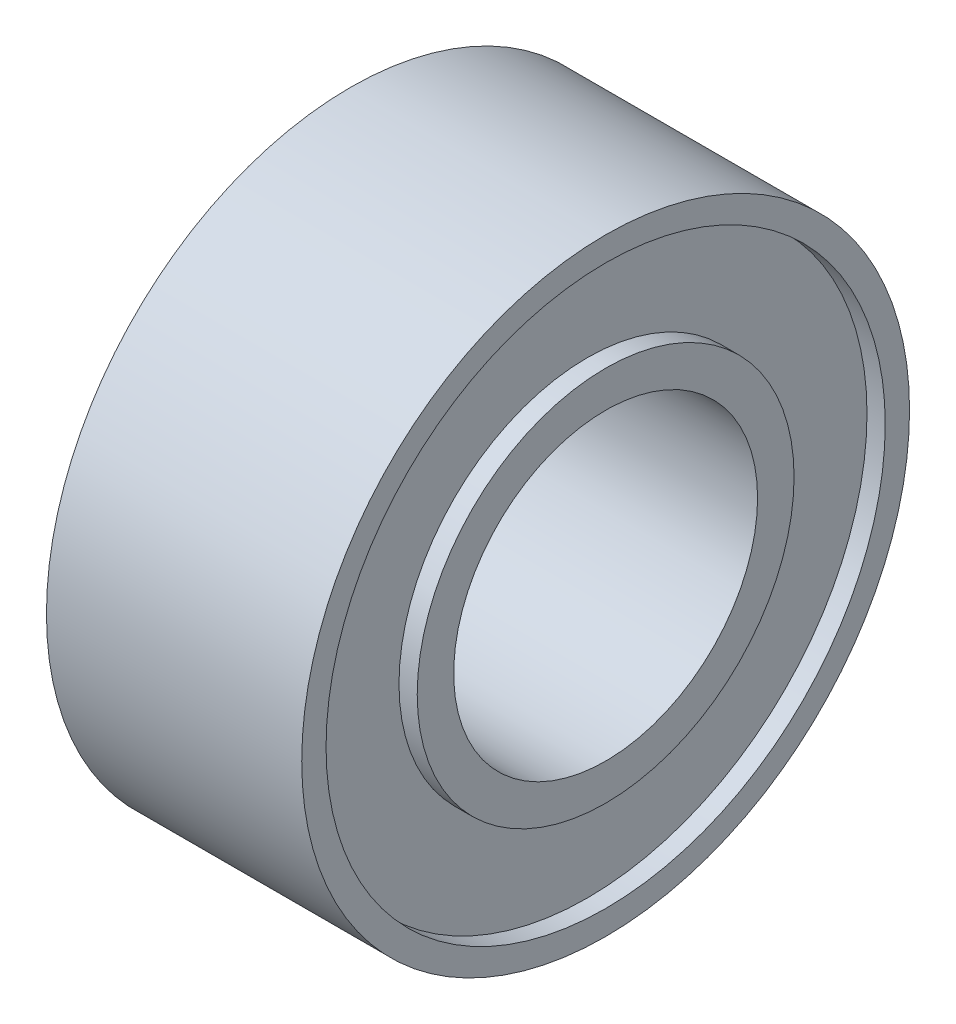
ISO-10303-21;
HEADER;
FILE_DESCRIPTION(('STEP AP214'),'2;1');
FILE_NAME('part.step','',(''),(''),'','','');
FILE_SCHEMA(('AUTOMOTIVE_DESIGN { 1 0 10303 214 1 1 1 1 }'));
ENDSEC;
DATA;
#1=APPLICATION_CONTEXT('core data for automotive mechanical design processes');
#2=APPLICATION_PROTOCOL_DEFINITION('international standard','automotive_design',2000,#1);
#3=PRODUCT_CONTEXT('',#1,'mechanical');
#4=PRODUCT('Part','Part','',(#3));
#5=PRODUCT_RELATED_PRODUCT_CATEGORY('part','',(#4));
#6=PRODUCT_DEFINITION_FORMATION('','',#4);
#7=PRODUCT_DEFINITION_CONTEXT('part definition',#1,'design');
#8=PRODUCT_DEFINITION('design','',#6,#7);
#9=PRODUCT_DEFINITION_SHAPE('','',#8);
#10=(LENGTH_UNIT() NAMED_UNIT(*) SI_UNIT(.MILLI.,.METRE.));
#11=(NAMED_UNIT(*) PLANE_ANGLE_UNIT() SI_UNIT($,.RADIAN.));
#12=(NAMED_UNIT(*) SI_UNIT($,.STERADIAN.) SOLID_ANGLE_UNIT());
#13=UNCERTAINTY_MEASURE_WITH_UNIT(LENGTH_MEASURE(1.E-05),#10,'distance_accuracy_value','');
#14=(GEOMETRIC_REPRESENTATION_CONTEXT(3) GLOBAL_UNCERTAINTY_ASSIGNED_CONTEXT((#13)) GLOBAL_UNIT_ASSIGNED_CONTEXT((#10,
#11,#12)) REPRESENTATION_CONTEXT('',''));
#15=CARTESIAN_POINT('',(0.,0.,0.));
#16=DIRECTION('',(0.,0.,1.));
#17=DIRECTION('',(1.,0.,0.));
#18=AXIS2_PLACEMENT_3D('',#15,#16,#17);
#19=CARTESIAN_POINT('',(-2.1,2.5,0.));
#20=DIRECTION('',(-1.,0.,0.));
#21=DIRECTION('',(0.,0.,1.));
#22=AXIS2_PLACEMENT_3D('',#19,#20,#21);
#23=PLANE('',#22);
#24=CARTESIAN_POINT('',(-2.1,0.,0.));
#25=DIRECTION('',(1.,0.,0.));
#26=DIRECTION('',(0.,0.,-1.));
#27=AXIS2_PLACEMENT_3D('',#24,#25,#26);
#28=CIRCLE('',#27,2.5);
#29=CARTESIAN_POINT('',(-2.1,0.,-2.5));
#30=VERTEX_POINT('',#29);
#31=EDGE_CURVE('E74',#30,#30,#28,.T.);
#32=ORIENTED_EDGE('',*,*,#31,.T.);
#33=EDGE_LOOP('',(#32));
#34=FACE_BOUND('',#33,.T.);
#35=CARTESIAN_POINT('',(-2.1,0.,0.));
#36=DIRECTION('',(1.,0.,0.));
#37=DIRECTION('',(0.,0.,-1.));
#38=AXIS2_PLACEMENT_3D('',#35,#36,#37);
#39=CIRCLE('',#38,3.1);
#40=CARTESIAN_POINT('',(-2.1,0.,-3.1));
#41=VERTEX_POINT('',#40);
#42=EDGE_CURVE('E10',#41,#41,#39,.T.);
#43=ORIENTED_EDGE('',*,*,#42,.F.);
#44=EDGE_LOOP('',(#43));
#45=FACE_BOUND('',#44,.T.);
#46=ADVANCED_FACE('F34',(#34,#45),#23,.T.);
#47=CARTESIAN_POINT('',(0.,0.,0.));
#48=DIRECTION('',(1.,0.,0.));
#49=DIRECTION('',(0.,0.,-1.));
#50=AXIS2_PLACEMENT_3D('',#47,#48,#49);
#51=CYLINDRICAL_SURFACE('',#50,3.1);
#52=ORIENTED_EDGE('',*,*,#42,.T.);
#53=EDGE_LOOP('',(#52));
#54=FACE_BOUND('',#53,.T.);
#55=CARTESIAN_POINT('',(-1.8,0.,0.));
#56=DIRECTION('',(1.,0.,0.));
#57=DIRECTION('',(0.,0.,-1.));
#58=AXIS2_PLACEMENT_3D('',#55,#56,#57);
#59=CIRCLE('',#58,3.1);
#60=CARTESIAN_POINT('',(-1.8,0.,-3.1));
#61=VERTEX_POINT('',#60);
#62=EDGE_CURVE('E40',#61,#61,#59,.T.);
#63=ORIENTED_EDGE('',*,*,#62,.F.);
#64=EDGE_LOOP('',(#63));
#65=FACE_BOUND('',#64,.T.);
#66=ADVANCED_FACE('F92',(#54,#65),#51,.T.);
#67=CARTESIAN_POINT('',(-1.8,3.1,0.));
#68=DIRECTION('',(-1.,0.,0.));
#69=DIRECTION('',(0.,0.,1.));
#70=AXIS2_PLACEMENT_3D('',#67,#68,#69);
#71=PLANE('',#70);
#72=ORIENTED_EDGE('',*,*,#62,.T.);
#73=EDGE_LOOP('',(#72));
#74=FACE_BOUND('',#73,.T.);
#75=CARTESIAN_POINT('',(-1.8,0.,0.));
#76=DIRECTION('',(1.,0.,0.));
#77=DIRECTION('',(0.,0.,-1.));
#78=AXIS2_PLACEMENT_3D('',#75,#76,#77);
#79=CIRCLE('',#78,4.6);
#80=CARTESIAN_POINT('',(-1.8,0.,-4.6));
#81=VERTEX_POINT('',#80);
#82=EDGE_CURVE('E44',#81,#81,#79,.T.);
#83=ORIENTED_EDGE('',*,*,#82,.F.);
#84=EDGE_LOOP('',(#83));
#85=FACE_BOUND('',#84,.T.);
#86=ADVANCED_FACE('F96',(#74,#85),#71,.T.);
#87=CARTESIAN_POINT('',(0.,0.,0.));
#88=DIRECTION('',(1.,0.,0.));
#89=DIRECTION('',(0.,0.,-1.));
#90=AXIS2_PLACEMENT_3D('',#87,#88,#89);
#91=CYLINDRICAL_SURFACE('',#90,4.6);
#92=ORIENTED_EDGE('',*,*,#82,.T.);
#93=EDGE_LOOP('',(#92));
#94=FACE_BOUND('',#93,.T.);
#95=CARTESIAN_POINT('',(-2.1,0.,0.));
#96=DIRECTION('',(1.,0.,0.));
#97=DIRECTION('',(0.,0.,-1.));
#98=AXIS2_PLACEMENT_3D('',#95,#96,#97);
#99=CIRCLE('',#98,4.6);
#100=CARTESIAN_POINT('',(-2.1,0.,-4.6));
#101=VERTEX_POINT('',#100);
#102=EDGE_CURVE('E48',#101,#101,#99,.T.);
#103=ORIENTED_EDGE('',*,*,#102,.F.);
#104=EDGE_LOOP('',(#103));
#105=FACE_BOUND('',#104,.T.);
#106=ADVANCED_FACE('F100',(#94,#105),#91,.F.);
#107=CARTESIAN_POINT('',(-2.1,4.6,0.));
#108=DIRECTION('',(-1.,0.,0.));
#109=DIRECTION('',(0.,0.,1.));
#110=AXIS2_PLACEMENT_3D('',#107,#108,#109);
#111=PLANE('',#110);
#112=ORIENTED_EDGE('',*,*,#102,.T.);
#113=EDGE_LOOP('',(#112));
#114=FACE_BOUND('',#113,.T.);
#115=CARTESIAN_POINT('',(-2.1,0.,0.));
#116=DIRECTION('',(1.,0.,0.));
#117=DIRECTION('',(0.,0.,-1.));
#118=AXIS2_PLACEMENT_3D('',#115,#116,#117);
#119=CIRCLE('',#118,5.);
#120=CARTESIAN_POINT('',(-2.1,0.,-5.));
#121=VERTEX_POINT('',#120);
#122=EDGE_CURVE('E53',#121,#121,#119,.T.);
#123=ORIENTED_EDGE('',*,*,#122,.F.);
#124=EDGE_LOOP('',(#123));
#125=FACE_BOUND('',#124,.T.);
#126=ADVANCED_FACE('F106',(#114,#125),#111,.T.);
#127=CARTESIAN_POINT('',(0.,0.,0.));
#128=DIRECTION('',(1.,0.,0.));
#129=DIRECTION('',(0.,0.,-1.));
#130=AXIS2_PLACEMENT_3D('',#127,#128,#129);
#131=CYLINDRICAL_SURFACE('',#130,5.);
#132=ORIENTED_EDGE('',*,*,#122,.T.);
#133=EDGE_LOOP('',(#132));
#134=FACE_BOUND('',#133,.T.);
#135=CARTESIAN_POINT('',(2.1,0.,0.));
#136=DIRECTION('',(1.,0.,0.));
#137=DIRECTION('',(0.,0.,-1.));
#138=AXIS2_PLACEMENT_3D('',#135,#136,#137);
#139=CIRCLE('',#138,5.);
#140=CARTESIAN_POINT('',(2.1,0.,-5.));
#141=VERTEX_POINT('',#140);
#142=EDGE_CURVE('E56',#141,#141,#139,.T.);
#143=ORIENTED_EDGE('',*,*,#142,.F.);
#144=EDGE_LOOP('',(#143));
#145=FACE_BOUND('',#144,.T.);
#146=ADVANCED_FACE('F110',(#134,#145),#131,.T.);
#147=CARTESIAN_POINT('',(2.1,4.6,0.));
#148=DIRECTION('',(1.,0.,0.));
#149=DIRECTION('',(0.,0.,-1.));
#150=AXIS2_PLACEMENT_3D('',#147,#148,#149);
#151=PLANE('',#150);
#152=ORIENTED_EDGE('',*,*,#142,.T.);
#153=EDGE_LOOP('',(#152));
#154=FACE_BOUND('',#153,.T.);
#155=CARTESIAN_POINT('',(2.1,0.,0.));
#156=DIRECTION('',(1.,0.,0.));
#157=DIRECTION('',(0.,0.,-1.));
#158=AXIS2_PLACEMENT_3D('',#155,#156,#157);
#159=CIRCLE('',#158,4.6);
#160=CARTESIAN_POINT('',(2.1,0.,-4.6));
#161=VERTEX_POINT('',#160);
#162=EDGE_CURVE('E59',#161,#161,#159,.T.);
#163=ORIENTED_EDGE('',*,*,#162,.F.);
#164=EDGE_LOOP('',(#163));
#165=FACE_BOUND('',#164,.T.);
#166=ADVANCED_FACE('F114',(#154,#165),#151,.T.);
#167=CARTESIAN_POINT('',(0.,0.,0.));
#168=DIRECTION('',(1.,0.,0.));
#169=DIRECTION('',(0.,0.,-1.));
#170=AXIS2_PLACEMENT_3D('',#167,#168,#169);
#171=CYLINDRICAL_SURFACE('',#170,4.6);
#172=ORIENTED_EDGE('',*,*,#162,.T.);
#173=EDGE_LOOP('',(#172));
#174=FACE_BOUND('',#173,.T.);
#175=CARTESIAN_POINT('',(1.8,0.,0.));
#176=DIRECTION('',(1.,0.,0.));
#177=DIRECTION('',(0.,0.,-1.));
#178=AXIS2_PLACEMENT_3D('',#175,#176,#177);
#179=CIRCLE('',#178,4.6);
#180=CARTESIAN_POINT('',(1.8,0.,-4.6));
#181=VERTEX_POINT('',#180);
#182=EDGE_CURVE('E62',#181,#181,#179,.T.);
#183=ORIENTED_EDGE('',*,*,#182,.F.);
#184=EDGE_LOOP('',(#183));
#185=FACE_BOUND('',#184,.T.);
#186=ADVANCED_FACE('F118',(#174,#185),#171,.F.);
#187=CARTESIAN_POINT('',(1.8,3.1,0.));
#188=DIRECTION('',(1.,0.,0.));
#189=DIRECTION('',(0.,0.,-1.));
#190=AXIS2_PLACEMENT_3D('',#187,#188,#189);
#191=PLANE('',#190);
#192=ORIENTED_EDGE('',*,*,#182,.T.);
#193=EDGE_LOOP('',(#192));
#194=FACE_BOUND('',#193,.T.);
#195=CARTESIAN_POINT('',(1.8,0.,0.));
#196=DIRECTION('',(1.,0.,0.));
#197=DIRECTION('',(0.,0.,-1.));
#198=AXIS2_PLACEMENT_3D('',#195,#196,#197);
#199=CIRCLE('',#198,3.1);
#200=CARTESIAN_POINT('',(1.8,0.,-3.1));
#201=VERTEX_POINT('',#200);
#202=EDGE_CURVE('E65',#201,#201,#199,.T.);
#203=ORIENTED_EDGE('',*,*,#202,.F.);
#204=EDGE_LOOP('',(#203));
#205=FACE_BOUND('',#204,.T.);
#206=ADVANCED_FACE('F122',(#194,#205),#191,.T.);
#207=CARTESIAN_POINT('',(0.,0.,0.));
#208=DIRECTION('',(1.,0.,0.));
#209=DIRECTION('',(0.,0.,-1.));
#210=AXIS2_PLACEMENT_3D('',#207,#208,#209);
#211=CYLINDRICAL_SURFACE('',#210,3.1);
#212=ORIENTED_EDGE('',*,*,#202,.T.);
#213=EDGE_LOOP('',(#212));
#214=FACE_BOUND('',#213,.T.);
#215=CARTESIAN_POINT('',(2.1,0.,0.));
#216=DIRECTION('',(1.,0.,0.));
#217=DIRECTION('',(0.,0.,-1.));
#218=AXIS2_PLACEMENT_3D('',#215,#216,#217);
#219=CIRCLE('',#218,3.1);
#220=CARTESIAN_POINT('',(2.1,0.,-3.1));
#221=VERTEX_POINT('',#220);
#222=EDGE_CURVE('E68',#221,#221,#219,.T.);
#223=ORIENTED_EDGE('',*,*,#222,.F.);
#224=EDGE_LOOP('',(#223));
#225=FACE_BOUND('',#224,.T.);
#226=ADVANCED_FACE('F88',(#214,#225),#211,.T.);
#227=CARTESIAN_POINT('',(2.1,2.5,0.));
#228=DIRECTION('',(1.,0.,0.));
#229=DIRECTION('',(0.,0.,-1.));
#230=AXIS2_PLACEMENT_3D('',#227,#228,#229);
#231=PLANE('',#230);
#232=ORIENTED_EDGE('',*,*,#222,.T.);
#233=EDGE_LOOP('',(#232));
#234=FACE_BOUND('',#233,.T.);
#235=CARTESIAN_POINT('',(2.1,0.,0.));
#236=DIRECTION('',(1.,0.,0.));
#237=DIRECTION('',(0.,0.,-1.));
#238=AXIS2_PLACEMENT_3D('',#235,#236,#237);
#239=CIRCLE('',#238,2.5);
#240=CARTESIAN_POINT('',(2.1,0.,-2.5));
#241=VERTEX_POINT('',#240);
#242=EDGE_CURVE('E71',#241,#241,#239,.T.);
#243=ORIENTED_EDGE('',*,*,#242,.F.);
#244=EDGE_LOOP('',(#243));
#245=FACE_BOUND('',#244,.T.);
#246=ADVANCED_FACE('F82',(#234,#245),#231,.T.);
#247=CARTESIAN_POINT('',(0.,0.,0.));
#248=DIRECTION('',(1.,0.,0.));
#249=DIRECTION('',(0.,0.,-1.));
#250=AXIS2_PLACEMENT_3D('',#247,#248,#249);
#251=CYLINDRICAL_SURFACE('',#250,2.5);
#252=ORIENTED_EDGE('',*,*,#242,.T.);
#253=EDGE_LOOP('',(#252));
#254=FACE_BOUND('',#253,.T.);
#255=ORIENTED_EDGE('',*,*,#31,.F.);
#256=EDGE_LOOP('',(#255));
#257=FACE_BOUND('',#256,.T.);
#258=ADVANCED_FACE('F80',(#254,#257),#251,.F.);
#259=CLOSED_SHELL('',(#46,#66,#86,#106,#126,#146,#166,#186,#206,#226,#246,#258));
#260=MANIFOLD_SOLID_BREP('B2',#259);
#261=ADVANCED_BREP_SHAPE_REPRESENTATION('',(#18,#260),#14);
#262=SHAPE_DEFINITION_REPRESENTATION(#9,#261);
ENDSEC;
END-ISO-10303-21;
